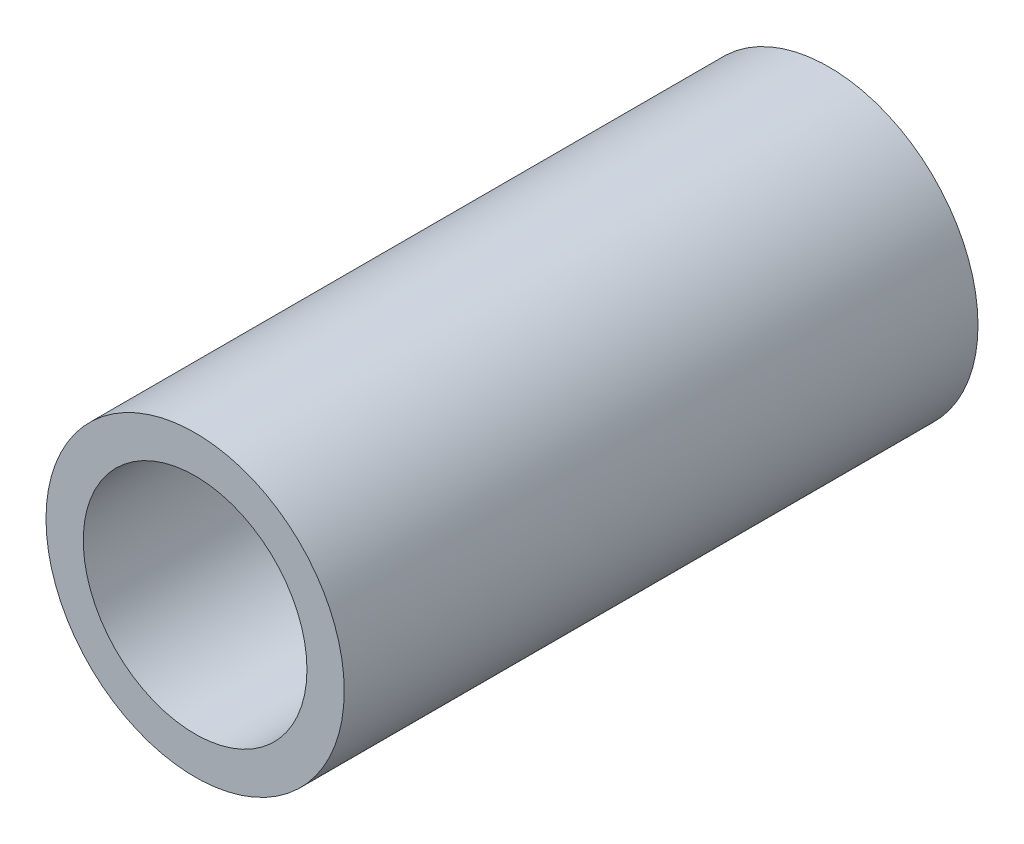
ISO-10303-21;
HEADER;
FILE_DESCRIPTION(('STEP AP214'),'2;1');
FILE_NAME('part.step','',(''),(''),'','','');
FILE_SCHEMA(('AUTOMOTIVE_DESIGN { 1 0 10303 214 1 1 1 1 }'));
ENDSEC;
DATA;
#1=APPLICATION_CONTEXT('core data for automotive mechanical design processes');
#2=APPLICATION_PROTOCOL_DEFINITION('international standard','automotive_design',2000,#1);
#3=PRODUCT_CONTEXT('',#1,'mechanical');
#4=PRODUCT('Part','Part','',(#3));
#5=PRODUCT_RELATED_PRODUCT_CATEGORY('part','',(#4));
#6=PRODUCT_DEFINITION_FORMATION('','',#4);
#7=PRODUCT_DEFINITION_CONTEXT('part definition',#1,'design');
#8=PRODUCT_DEFINITION('design','',#6,#7);
#9=PRODUCT_DEFINITION_SHAPE('','',#8);
#10=(LENGTH_UNIT() NAMED_UNIT(*) SI_UNIT(.MILLI.,.METRE.));
#11=(NAMED_UNIT(*) PLANE_ANGLE_UNIT() SI_UNIT($,.RADIAN.));
#12=(NAMED_UNIT(*) SI_UNIT($,.STERADIAN.) SOLID_ANGLE_UNIT());
#13=UNCERTAINTY_MEASURE_WITH_UNIT(LENGTH_MEASURE(1.E-05),#10,'distance_accuracy_value','');
#14=(GEOMETRIC_REPRESENTATION_CONTEXT(3) GLOBAL_UNCERTAINTY_ASSIGNED_CONTEXT((#13)) GLOBAL_UNIT_ASSIGNED_CONTEXT((#10,
#11,#12)) REPRESENTATION_CONTEXT('',''));
#15=CARTESIAN_POINT('',(0.,0.,0.));
#16=DIRECTION('',(0.,0.,1.));
#17=DIRECTION('',(1.,0.,0.));
#18=AXIS2_PLACEMENT_3D('',#15,#16,#17);
#19=CARTESIAN_POINT('',(0.,0.,8.5));
#20=DIRECTION('',(0.,0.,1.));
#21=DIRECTION('',(1.,0.,0.));
#22=AXIS2_PLACEMENT_3D('',#19,#20,#21);
#23=PLANE('',#22);
#24=CARTESIAN_POINT('',(0.,0.,8.5));
#25=DIRECTION('',(0.,0.,1.));
#26=DIRECTION('',(1.,0.,0.));
#27=AXIS2_PLACEMENT_3D('',#24,#25,#26);
#28=CIRCLE('',#27,2.);
#29=CARTESIAN_POINT('',(2.,0.,8.5));
#30=VERTEX_POINT('',#29);
#31=EDGE_CURVE('E10',#30,#30,#28,.T.);
#32=ORIENTED_EDGE('',*,*,#31,.T.);
#33=EDGE_LOOP('',(#32));
#34=FACE_BOUND('',#33,.T.);
#35=CARTESIAN_POINT('',(0.,0.,8.5));
#36=DIRECTION('',(0.,0.,1.));
#37=DIRECTION('',(1.,0.,0.));
#38=AXIS2_PLACEMENT_3D('',#35,#36,#37);
#39=CIRCLE('',#38,1.5);
#40=CARTESIAN_POINT('',(1.5,0.,8.5));
#41=VERTEX_POINT('',#40);
#42=EDGE_CURVE('E46',#41,#41,#39,.T.);
#43=ORIENTED_EDGE('',*,*,#42,.F.);
#44=EDGE_LOOP('',(#43));
#45=FACE_BOUND('',#44,.T.);
#46=ADVANCED_FACE('F35',(#34,#45),#23,.T.);
#47=CARTESIAN_POINT('',(0.,0.,0.));
#48=DIRECTION('',(0.,0.,1.));
#49=DIRECTION('',(1.,0.,0.));
#50=AXIS2_PLACEMENT_3D('',#47,#48,#49);
#51=PLANE('',#50);
#52=CARTESIAN_POINT('',(0.,0.,0.));
#53=DIRECTION('',(0.,0.,1.));
#54=DIRECTION('',(1.,0.,0.));
#55=AXIS2_PLACEMENT_3D('',#52,#53,#54);
#56=CIRCLE('',#55,2.);
#57=CARTESIAN_POINT('',(2.,0.,0.));
#58=VERTEX_POINT('',#57);
#59=EDGE_CURVE('E39',#58,#58,#56,.T.);
#60=ORIENTED_EDGE('',*,*,#59,.F.);
#61=EDGE_LOOP('',(#60));
#62=FACE_BOUND('',#61,.T.);
#63=CARTESIAN_POINT('',(0.,0.,0.));
#64=DIRECTION('',(0.,0.,1.));
#65=DIRECTION('',(1.,0.,0.));
#66=AXIS2_PLACEMENT_3D('',#63,#64,#65);
#67=CIRCLE('',#66,1.5);
#68=CARTESIAN_POINT('',(1.5,0.,0.));
#69=VERTEX_POINT('',#68);
#70=EDGE_CURVE('E48',#69,#69,#67,.T.);
#71=ORIENTED_EDGE('',*,*,#70,.T.);
#72=EDGE_LOOP('',(#71));
#73=FACE_BOUND('',#72,.T.);
#74=ADVANCED_FACE('F58',(#62,#73),#51,.F.);
#75=CARTESIAN_POINT('',(0.,0.,8.5));
#76=DIRECTION('',(0.,0.,-1.));
#77=DIRECTION('',(-1.,0.,0.));
#78=AXIS2_PLACEMENT_3D('',#75,#76,#77);
#79=CYLINDRICAL_SURFACE('',#78,2.);
#80=ORIENTED_EDGE('',*,*,#31,.F.);
#81=EDGE_LOOP('',(#80));
#82=FACE_BOUND('',#81,.T.);
#83=ORIENTED_EDGE('',*,*,#59,.T.);
#84=EDGE_LOOP('',(#83));
#85=FACE_BOUND('',#84,.T.);
#86=ADVANCED_FACE('F37',(#82,#85),#79,.T.);
#87=CARTESIAN_POINT('',(0.,0.,8.5));
#88=DIRECTION('',(0.,0.,-1.));
#89=DIRECTION('',(-1.,0.,0.));
#90=AXIS2_PLACEMENT_3D('',#87,#88,#89);
#91=CYLINDRICAL_SURFACE('',#90,1.5);
#92=ORIENTED_EDGE('',*,*,#42,.T.);
#93=EDGE_LOOP('',(#92));
#94=FACE_BOUND('',#93,.T.);
#95=ORIENTED_EDGE('',*,*,#70,.F.);
#96=EDGE_LOOP('',(#95));
#97=FACE_BOUND('',#96,.T.);
#98=ADVANCED_FACE('F54',(#94,#97),#91,.F.);
#99=CLOSED_SHELL('',(#46,#74,#86,#98));
#100=MANIFOLD_SOLID_BREP('B2',#99);
#101=ADVANCED_BREP_SHAPE_REPRESENTATION('',(#18,#100),#14);
#102=SHAPE_DEFINITION_REPRESENTATION(#9,#101);
ENDSEC;
END-ISO-10303-21;
